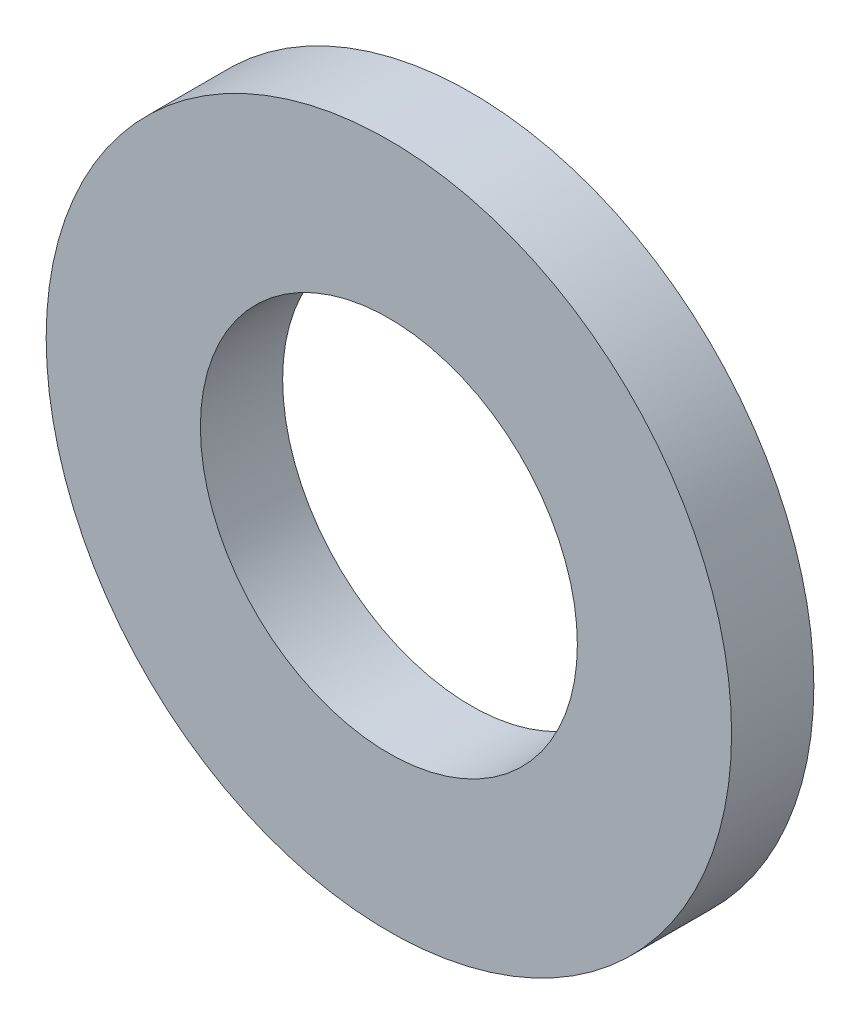
ISO-10303-21;
HEADER;
FILE_DESCRIPTION(('STEP AP214'),'2;1');
FILE_NAME('part.step','',(''),(''),'','','');
FILE_SCHEMA(('AUTOMOTIVE_DESIGN { 1 0 10303 214 1 1 1 1 }'));
ENDSEC;
DATA;
#1=APPLICATION_CONTEXT('core data for automotive mechanical design processes');
#2=APPLICATION_PROTOCOL_DEFINITION('international standard','automotive_design',2000,#1);
#3=PRODUCT_CONTEXT('',#1,'mechanical');
#4=PRODUCT('Part','Part','',(#3));
#5=PRODUCT_RELATED_PRODUCT_CATEGORY('part','',(#4));
#6=PRODUCT_DEFINITION_FORMATION('','',#4);
#7=PRODUCT_DEFINITION_CONTEXT('part definition',#1,'design');
#8=PRODUCT_DEFINITION('design','',#6,#7);
#9=PRODUCT_DEFINITION_SHAPE('','',#8);
#10=(LENGTH_UNIT() NAMED_UNIT(*) SI_UNIT(.MILLI.,.METRE.));
#11=(NAMED_UNIT(*) PLANE_ANGLE_UNIT() SI_UNIT($,.RADIAN.));
#12=(NAMED_UNIT(*) SI_UNIT($,.STERADIAN.) SOLID_ANGLE_UNIT());
#13=UNCERTAINTY_MEASURE_WITH_UNIT(LENGTH_MEASURE(1.E-05),#10,'distance_accuracy_value','');
#14=(GEOMETRIC_REPRESENTATION_CONTEXT(3) GLOBAL_UNCERTAINTY_ASSIGNED_CONTEXT((#13)) GLOBAL_UNIT_ASSIGNED_CONTEXT((#10,
#11,#12)) REPRESENTATION_CONTEXT('',''));
#15=CARTESIAN_POINT('',(0.,0.,0.));
#16=DIRECTION('',(0.,0.,1.));
#17=DIRECTION('',(1.,0.,0.));
#18=AXIS2_PLACEMENT_3D('',#15,#16,#17);
#19=CARTESIAN_POINT('',(0.,0.,1.2));
#20=DIRECTION('',(0.,0.,1.));
#21=DIRECTION('',(1.,0.,0.));
#22=AXIS2_PLACEMENT_3D('',#19,#20,#21);
#23=PLANE('',#22);
#24=CARTESIAN_POINT('',(0.,0.,1.2));
#25=DIRECTION('',(0.,0.,1.));
#26=DIRECTION('',(1.,0.,0.));
#27=AXIS2_PLACEMENT_3D('',#24,#25,#26);
#28=CIRCLE('',#27,5.);
#29=CARTESIAN_POINT('',(5.,0.,1.2));
#30=VERTEX_POINT('',#29);
#31=EDGE_CURVE('E10',#30,#30,#28,.T.);
#32=ORIENTED_EDGE('',*,*,#31,.T.);
#33=EDGE_LOOP('',(#32));
#34=FACE_BOUND('',#33,.T.);
#35=CARTESIAN_POINT('',(0.,0.,1.2));
#36=DIRECTION('',(0.,0.,1.));
#37=DIRECTION('',(1.,0.,0.));
#38=AXIS2_PLACEMENT_3D('',#35,#36,#37);
#39=CIRCLE('',#38,2.75);
#40=CARTESIAN_POINT('',(2.75,0.,1.2));
#41=VERTEX_POINT('',#40);
#42=EDGE_CURVE('E41',#41,#41,#39,.T.);
#43=ORIENTED_EDGE('',*,*,#42,.F.);
#44=EDGE_LOOP('',(#43));
#45=FACE_BOUND('',#44,.T.);
#46=ADVANCED_FACE('F30',(#34,#45),#23,.T.);
#47=CARTESIAN_POINT('',(0.,0.,0.));
#48=DIRECTION('',(0.,0.,1.));
#49=DIRECTION('',(1.,0.,0.));
#50=AXIS2_PLACEMENT_3D('',#47,#48,#49);
#51=PLANE('',#50);
#52=CARTESIAN_POINT('',(0.,0.,0.));
#53=DIRECTION('',(0.,0.,1.));
#54=DIRECTION('',(1.,0.,0.));
#55=AXIS2_PLACEMENT_3D('',#52,#53,#54);
#56=CIRCLE('',#55,5.);
#57=CARTESIAN_POINT('',(5.,0.,0.));
#58=VERTEX_POINT('',#57);
#59=EDGE_CURVE('E34',#58,#58,#56,.T.);
#60=ORIENTED_EDGE('',*,*,#59,.F.);
#61=EDGE_LOOP('',(#60));
#62=FACE_BOUND('',#61,.T.);
#63=CARTESIAN_POINT('',(0.,0.,0.));
#64=DIRECTION('',(0.,0.,1.));
#65=DIRECTION('',(1.,0.,0.));
#66=AXIS2_PLACEMENT_3D('',#63,#64,#65);
#67=CIRCLE('',#66,2.75);
#68=CARTESIAN_POINT('',(2.75,0.,0.));
#69=VERTEX_POINT('',#68);
#70=EDGE_CURVE('E43',#69,#69,#67,.T.);
#71=ORIENTED_EDGE('',*,*,#70,.T.);
#72=EDGE_LOOP('',(#71));
#73=FACE_BOUND('',#72,.T.);
#74=ADVANCED_FACE('F53',(#62,#73),#51,.F.);
#75=CARTESIAN_POINT('',(0.,0.,1.2));
#76=DIRECTION('',(0.,0.,-1.));
#77=DIRECTION('',(-1.,0.,0.));
#78=AXIS2_PLACEMENT_3D('',#75,#76,#77);
#79=CYLINDRICAL_SURFACE('',#78,5.);
#80=ORIENTED_EDGE('',*,*,#31,.F.);
#81=EDGE_LOOP('',(#80));
#82=FACE_BOUND('',#81,.T.);
#83=ORIENTED_EDGE('',*,*,#59,.T.);
#84=EDGE_LOOP('',(#83));
#85=FACE_BOUND('',#84,.T.);
#86=ADVANCED_FACE('F32',(#82,#85),#79,.T.);
#87=CARTESIAN_POINT('',(0.,0.,1.2));
#88=DIRECTION('',(0.,0.,-1.));
#89=DIRECTION('',(-1.,0.,0.));
#90=AXIS2_PLACEMENT_3D('',#87,#88,#89);
#91=CYLINDRICAL_SURFACE('',#90,2.75);
#92=ORIENTED_EDGE('',*,*,#42,.T.);
#93=EDGE_LOOP('',(#92));
#94=FACE_BOUND('',#93,.T.);
#95=ORIENTED_EDGE('',*,*,#70,.F.);
#96=EDGE_LOOP('',(#95));
#97=FACE_BOUND('',#96,.T.);
#98=ADVANCED_FACE('F49',(#94,#97),#91,.F.);
#99=CLOSED_SHELL('',(#46,#74,#86,#98));
#100=MANIFOLD_SOLID_BREP('B2',#99);
#101=ADVANCED_BREP_SHAPE_REPRESENTATION('',(#18,#100),#14);
#102=SHAPE_DEFINITION_REPRESENTATION(#9,#101);
ENDSEC;
END-ISO-10303-21;
